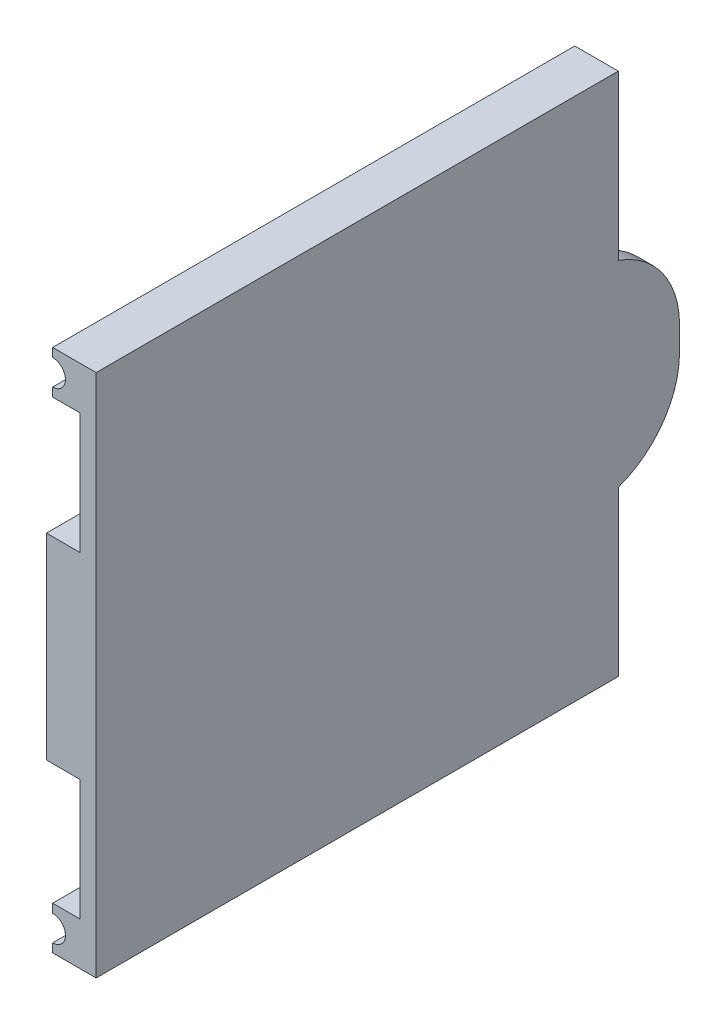
ISO-10303-21;
HEADER;
FILE_DESCRIPTION(('STEP AP214'),'2;1');
FILE_NAME('part.step','',(''),(''),'','','');
FILE_SCHEMA(('AUTOMOTIVE_DESIGN { 1 0 10303 214 1 1 1 1 }'));
ENDSEC;
DATA;
#1=APPLICATION_CONTEXT('core data for automotive mechanical design processes');
#2=APPLICATION_PROTOCOL_DEFINITION('international standard','automotive_design',2000,#1);
#3=PRODUCT_CONTEXT('',#1,'mechanical');
#4=PRODUCT('Part','Part','',(#3));
#5=PRODUCT_RELATED_PRODUCT_CATEGORY('part','',(#4));
#6=PRODUCT_DEFINITION_FORMATION('','',#4);
#7=PRODUCT_DEFINITION_CONTEXT('part definition',#1,'design');
#8=PRODUCT_DEFINITION('design','',#6,#7);
#9=PRODUCT_DEFINITION_SHAPE('','',#8);
#10=(LENGTH_UNIT() NAMED_UNIT(*) SI_UNIT(.MILLI.,.METRE.));
#11=(NAMED_UNIT(*) PLANE_ANGLE_UNIT() SI_UNIT($,.RADIAN.));
#12=(NAMED_UNIT(*) SI_UNIT($,.STERADIAN.) SOLID_ANGLE_UNIT());
#13=UNCERTAINTY_MEASURE_WITH_UNIT(LENGTH_MEASURE(1.E-05),#10,'distance_accuracy_value','');
#14=(GEOMETRIC_REPRESENTATION_CONTEXT(3) GLOBAL_UNCERTAINTY_ASSIGNED_CONTEXT((#13)) GLOBAL_UNIT_ASSIGNED_CONTEXT((#10,
#11,#12)) REPRESENTATION_CONTEXT('',''));
#15=CARTESIAN_POINT('',(0.,0.,0.));
#16=DIRECTION('',(0.,0.,1.));
#17=DIRECTION('',(1.,0.,0.));
#18=AXIS2_PLACEMENT_3D('',#15,#16,#17);
#19=CARTESIAN_POINT('',(-3.31919890539199,-3.42083956571834,-112.268207683529));
#20=DIRECTION('',(-1.,0.,0.));
#21=DIRECTION('',(0.,-1.,0.));
#22=AXIS2_PLACEMENT_3D('',#19,#20,#21);
#23=PLANE('',#22);
#24=DIRECTION('',(0.,0.,-1.));
#25=VECTOR('',#24,1.);
#26=CARTESIAN_POINT('',(-3.31919890539199,1.27705093993988,7.57724668597268));
#27=LINE('',#26,#25);
#28=CARTESIAN_POINT('',(-3.31919890539199,1.27705093993988,2.));
#29=VERTEX_POINT('',#28);
#30=CARTESIAN_POINT('',(-3.31919890539199,1.27705093993988,-55.));
#31=VERTEX_POINT('',#30);
#32=EDGE_CURVE('E225',#29,#31,#27,.T.);
#33=ORIENTED_EDGE('',*,*,#32,.F.);
#34=DIRECTION('',(0.,-1.,0.));
#35=VECTOR('',#34,1.);
#36=CARTESIAN_POINT('',(-3.31919890539199,0.,2.));
#37=LINE('',#36,#35);
#38=CARTESIAN_POINT('',(-3.31919890539199,14.4716869329902,2.));
#39=VERTEX_POINT('',#38);
#40=EDGE_CURVE('E209',#39,#29,#37,.T.);
#41=ORIENTED_EDGE('',*,*,#40,.F.);
#42=DIRECTION('',(0.,0.,-1.));
#43=VECTOR('',#42,1.);
#44=CARTESIAN_POINT('',(-3.31919890539199,14.4716869329902,2.));
#45=LINE('',#44,#43);
#46=CARTESIAN_POINT('',(-3.31919890539199,14.4716869329902,0.));
#47=VERTEX_POINT('',#46);
#48=EDGE_CURVE('E424',#39,#47,#45,.T.);
#49=ORIENTED_EDGE('',*,*,#48,.T.);
#50=DIRECTION('',(0.,-1.,0.));
#51=VECTOR('',#50,1.);
#52=CARTESIAN_POINT('',(-3.31919890539199,-3.42083956571834,0.));
#53=LINE('',#52,#51);
#54=CARTESIAN_POINT('',(-3.31919890539199,35.9283130670098,0.));
#55=VERTEX_POINT('',#54);
#56=EDGE_CURVE('E431',#55,#47,#53,.T.);
#57=ORIENTED_EDGE('',*,*,#56,.F.);
#58=DIRECTION('',(0.,0.,-1.));
#59=VECTOR('',#58,1.);
#60=CARTESIAN_POINT('',(-3.31919890539199,35.9283130670098,2.));
#61=LINE('',#60,#59);
#62=CARTESIAN_POINT('',(-3.31919890539199,35.9283130670098,2.));
#63=VERTEX_POINT('',#62);
#64=EDGE_CURVE('E421',#63,#55,#61,.T.);
#65=ORIENTED_EDGE('',*,*,#64,.F.);
#66=CARTESIAN_POINT('',(-3.31919890539199,49.1229490600601,2.));
#67=VERTEX_POINT('',#66);
#68=EDGE_CURVE('E414',#67,#63,#37,.T.);
#69=ORIENTED_EDGE('',*,*,#68,.F.);
#70=DIRECTION('',(0.,0.,-1.));
#71=VECTOR('',#70,1.);
#72=CARTESIAN_POINT('',(-3.31919890539199,49.1229490600601,7.57724668597268));
#73=LINE('',#72,#71);
#74=CARTESIAN_POINT('',(-3.31919890539199,49.1229490600601,-55.));
#75=VERTEX_POINT('',#74);
#76=EDGE_CURVE('E61',#67,#75,#73,.T.);
#77=ORIENTED_EDGE('',*,*,#76,.T.);
#78=DIRECTION('',(0.,-1.,0.));
#79=VECTOR('',#78,1.);
#80=CARTESIAN_POINT('',(-3.31919890539199,-3.42083956571834,-55.));
#81=LINE('',#80,#79);
#82=CARTESIAN_POINT('',(-3.31919890539199,35.9283130670098,-55.));
#83=VERTEX_POINT('',#82);
#84=EDGE_CURVE('E438',#75,#83,#81,.T.);
#85=ORIENTED_EDGE('',*,*,#84,.T.);
#86=CARTESIAN_POINT('',(-3.31919890539199,26.4921789622735,-51.6895056022655));
#87=DIRECTION('',(-1.,0.,0.));
#88=DIRECTION('',(0.,-1.,0.));
#89=AXIS2_PLACEMENT_3D('',#86,#87,#88);
#90=CIRCLE('',#89,10.);
#91=CARTESIAN_POINT('',(-3.31919890539199,26.4921789622735,-61.6895056022655));
#92=VERTEX_POINT('',#91);
#93=EDGE_CURVE('E355',#83,#92,#90,.T.);
#94=ORIENTED_EDGE('',*,*,#93,.T.);
#95=DIRECTION('',(0.,-1.,0.));
#96=VECTOR('',#95,1.);
#97=CARTESIAN_POINT('',(-3.31919890539199,14.4716869329902,-61.6895056022655));
#98=LINE('',#97,#96);
#99=CARTESIAN_POINT('',(-3.31919890539199,23.9078210377265,-61.6895056022655));
#100=VERTEX_POINT('',#99);
#101=EDGE_CURVE('E382',#92,#100,#98,.T.);
#102=ORIENTED_EDGE('',*,*,#101,.T.);
#103=CARTESIAN_POINT('',(-3.31919890539199,23.9078210377265,-51.6895056022655));
#104=DIRECTION('',(-1.,0.,0.));
#105=DIRECTION('',(0.,-1.,0.));
#106=AXIS2_PLACEMENT_3D('',#103,#104,#105);
#107=CIRCLE('',#106,10.);
#108=CARTESIAN_POINT('',(-3.31919890539199,14.4716869329902,-55.));
#109=VERTEX_POINT('',#108);
#110=EDGE_CURVE('E352',#100,#109,#107,.T.);
#111=ORIENTED_EDGE('',*,*,#110,.T.);
#112=EDGE_CURVE('E434',#109,#31,#81,.T.);
#113=ORIENTED_EDGE('',*,*,#112,.T.);
#114=EDGE_LOOP('',(#33,#41,#49,#57,#65,#69,#77,#85,#94,#102,#111,#113));
#115=FACE_BOUND('',#114,.T.);
#116=CARTESIAN_POINT('',(-3.31919890539199,30.39538039286,-58.0220039860049));
#117=CARTESIAN_POINT('',(-3.319198905392,30.3953731677678,-57.9714231862092));
#118=CARTESIAN_POINT('',(-3.31919890539199,30.3904428501182,-57.9208138964504));
#119=CARTESIAN_POINT('',(-3.31919890539199,30.3713428542698,-57.8213627240695));
#120=CARTESIAN_POINT('',(-3.31919890539199,30.3571584414699,-57.7725237913805));
#121=CARTESIAN_POINT('',(-3.31919890539199,30.3169845291881,-57.6671245654956));
#122=CARTESIAN_POINT('',(-3.31919890539199,30.2890499131978,-57.6113181412229));
#123=CARTESIAN_POINT('',(-3.31919890539199,30.2246526683806,-57.5048902492402));
#124=CARTESIAN_POINT('',(-3.31919890539199,30.188172693613,-57.454279632934));
#125=CARTESIAN_POINT('',(-3.31919890539199,30.1157090989328,-57.3660134687457));
#126=CARTESIAN_POINT('',(-3.31919890539199,30.0806318861256,-57.3275966374521));
#127=CARTESIAN_POINT('',(-3.31919890539199,30.0072792731913,-57.2539202831425));
#128=CARTESIAN_POINT('',(-3.31919890539199,29.9690015660918,-57.2186630762326));
#129=CARTESIAN_POINT('',(-3.31919890539199,29.8899565341299,-57.1509361506898));
#130=CARTESIAN_POINT('',(-3.31919890539199,29.8491848503902,-57.1184715657334));
#131=CARTESIAN_POINT('',(-3.31919890539199,29.7657397238641,-57.0560724165571));
#132=CARTESIAN_POINT('',(-3.31919890539199,29.7230655339333,-57.0261388599198));
#133=CARTESIAN_POINT('',(-3.31919890539199,29.5872628134364,-56.9360219822473));
#134=CARTESIAN_POINT('',(-3.31919890539199,29.4915053599603,-56.879792202171));
#135=CARTESIAN_POINT('',(-3.31919890539199,29.295683757485,-56.7753706745368));
#136=CARTESIAN_POINT('',(-3.31919890539199,29.1956149578093,-56.7271878950047));
#137=CARTESIAN_POINT('',(-3.31919890539199,28.9923808342592,-56.6373684555593));
#138=CARTESIAN_POINT('',(-3.31919890539199,28.8892100667907,-56.5957442128531));
#139=CARTESIAN_POINT('',(-3.31919890539199,28.6808438705801,-56.5181271895554));
#140=CARTESIAN_POINT('',(-3.31919890539199,28.5756492855732,-56.4821321169316));
#141=CARTESIAN_POINT('',(-3.31919890539199,28.3441683831376,-56.4087923640118));
#142=CARTESIAN_POINT('',(-3.31919890539199,28.2175736395103,-56.3724254082112));
#143=CARTESIAN_POINT('',(-3.31919890539199,27.9628280429387,-56.3055809304653));
#144=CARTESIAN_POINT('',(-3.31919890539199,27.834676870222,-56.2751046412967));
#145=CARTESIAN_POINT('',(-3.31919890539199,27.5771210469917,-56.2193723681457));
#146=CARTESIAN_POINT('',(-3.31919890539199,27.4477153057603,-56.1941214524956));
#147=CARTESIAN_POINT('',(-3.31919890539199,27.1880564189304,-56.1484038157457));
#148=CARTESIAN_POINT('',(-3.31919890539199,27.0578031787471,-56.127937638395));
#149=CARTESIAN_POINT('',(-3.31919890539199,26.6653657759517,-56.0730676320124));
#150=CARTESIAN_POINT('',(-3.31919890539199,26.4022291571331,-56.0453443749056));
#151=CARTESIAN_POINT('',(-3.31919890539199,25.8747784650301,-56.0059557222565));
#152=CARTESIAN_POINT('',(-3.31919890539199,25.6104642890529,-55.994291755849));
#153=CARTESIAN_POINT('',(-3.31919890539199,25.1435221586544,-55.9873248347716));
#154=CARTESIAN_POINT('',(-3.31919890539199,24.940936421042,-55.9888313715245));
#155=CARTESIAN_POINT('',(-3.31919890539199,24.5359631366222,-56.0009613699963));
#156=CARTESIAN_POINT('',(-3.31919890539199,24.3335756799347,-56.011587912716));
#157=CARTESIAN_POINT('',(-3.31919890539199,23.9293326267976,-56.0423230594862));
#158=CARTESIAN_POINT('',(-3.31919890539199,23.7274776585225,-56.0624400358134));
#159=CARTESIAN_POINT('',(-3.31919890539199,23.3259243968418,-56.112761554933));
#160=CARTESIAN_POINT('',(-3.31919890539199,23.1262205156411,-56.1429211503804));
#161=CARTESIAN_POINT('',(-3.31919890539199,22.7289326722818,-56.2145017253372));
#162=CARTESIAN_POINT('',(-3.31919890539199,22.5313473026992,-56.2559146758846));
#163=CARTESIAN_POINT('',(-3.31919890539199,22.2375325393806,-56.3279034152221));
#164=CARTESIAN_POINT('',(-3.31919890539199,22.1400793035915,-56.3535261885522));
#165=CARTESIAN_POINT('',(-3.31919890539199,21.9462113548207,-56.4084225369297));
#166=CARTESIAN_POINT('',(-3.31919890539199,21.8497965030453,-56.4376956173174));
#167=CARTESIAN_POINT('',(-3.31919890539199,21.6640695428524,-56.4984526214002));
#168=CARTESIAN_POINT('',(-3.31919890539199,21.5746794472597,-56.5296971280238));
#169=CARTESIAN_POINT('',(-3.31919890539199,21.3974141159262,-56.596300067779));
#170=CARTESIAN_POINT('',(-3.31919890539199,21.3095391692124,-56.6316592760696));
#171=CARTESIAN_POINT('',(-3.31919890539199,21.1360249020998,-56.7070443854754));
#172=CARTESIAN_POINT('',(-3.31919890539199,21.0503811255592,-56.7470599449164));
#173=CARTESIAN_POINT('',(-3.31919890539199,20.8819424437043,-56.8326506848188));
#174=CARTESIAN_POINT('',(-3.31919890539198,20.7991459626123,-56.8782227245465));
#175=CARTESIAN_POINT('',(-3.31919890539199,20.6390922391424,-56.9751787586836));
#176=CARTESIAN_POINT('',(-3.31919890539199,20.5617603353206,-57.0264380386874));
#177=CARTESIAN_POINT('',(-3.31919890539199,20.412836745902,-57.1369586754763));
#178=CARTESIAN_POINT('',(-3.31919890539198,20.3412466612905,-57.1962222518131));
#179=CARTESIAN_POINT('',(-3.31919890539198,20.2215432029528,-57.3109317119151));
#180=CARTESIAN_POINT('',(-3.31919890539198,20.171671946706,-57.3645183460734));
#181=CARTESIAN_POINT('',(-3.319198905392,20.0805819759779,-57.4786395024072));
#182=CARTESIAN_POINT('',(-3.31919890539202,20.0393416458471,-57.5391560656594));
#183=CARTESIAN_POINT('',(-3.31919890539198,19.9809419723428,-57.6465733669036));
#184=CARTESIAN_POINT('',(-3.31919890539195,19.9603063346008,-57.6915653566236));
#185=CARTESIAN_POINT('',(-3.31919890539204,19.926521556339,-57.7842891963429));
#186=CARTESIAN_POINT('',(-3.31919890539216,19.9133632574716,-57.8320176154616));
#187=CARTESIAN_POINT('',(-3.31919890539216,19.8958130532288,-57.9294889410442));
#188=CARTESIAN_POINT('',(-3.31919890539203,19.8914900171774,-57.9792446129013));
#189=CARTESIAN_POINT('',(-3.31919890539195,19.8923694542091,-58.0786750454448));
#190=CARTESIAN_POINT('',(-3.31919890539201,19.8975723282995,-58.1283498026368));
#191=CARTESIAN_POINT('',(-3.31919890539203,19.9158691982099,-58.2209828650277));
#192=CARTESIAN_POINT('',(-3.319198905392,19.928118052928,-58.2641146168201));
#193=CARTESIAN_POINT('',(-3.31919890539198,19.9587596325662,-58.3481833731503));
#194=CARTESIAN_POINT('',(-3.31919890539199,19.9771642452009,-58.3891159518495));
#195=CARTESIAN_POINT('',(-3.319198905392,20.0318627183695,-58.4928405918846));
#196=CARTESIAN_POINT('',(-3.31919890539199,20.0721813029291,-58.5534988240355));
#197=CARTESIAN_POINT('',(-3.31919890539199,20.1615715166141,-58.6679373037319));
#198=CARTESIAN_POINT('',(-3.319198905392,20.2106657615316,-58.7216991486255));
#199=CARTESIAN_POINT('',(-3.319198905392,20.3105801276217,-58.8190933230603));
#200=CARTESIAN_POINT('',(-3.31919890539199,20.3609549885067,-58.8631907866005));
#201=CARTESIAN_POINT('',(-3.31919890539199,20.4651734364998,-58.94686867483));
#202=CARTESIAN_POINT('',(-3.31919890539199,20.5190123276383,-58.9864550211845));
#203=CARTESIAN_POINT('',(-3.31919890539199,20.6294191831758,-59.0619073101988));
#204=CARTESIAN_POINT('',(-3.31919890539199,20.6859939165941,-59.0977632522511));
#205=CARTESIAN_POINT('',(-3.31919890539199,20.8011214163746,-59.1661653354187));
#206=CARTESIAN_POINT('',(-3.31919890539199,20.8596748673699,-59.1987103149983));
#207=CARTESIAN_POINT('',(-3.31919890539199,20.9863832075026,-59.2651376457134));
#208=CARTESIAN_POINT('',(-3.31919890539199,21.0547587464282,-59.298597387727));
#209=CARTESIAN_POINT('',(-3.31919890539199,21.19301768285,-59.3622571666419));
#210=CARTESIAN_POINT('',(-3.31919890539199,21.262901453369,-59.3924563857884));
#211=CARTESIAN_POINT('',(-3.31919890539199,21.4743940363404,-59.4787871751972));
#212=CARTESIAN_POINT('',(-3.31919890539199,21.617766680877,-59.5306126582118));
#213=CARTESIAN_POINT('',(-3.31919890539199,21.9079038705174,-59.6251038848786));
#214=CARTESIAN_POINT('',(-3.31919890539199,22.0546773263706,-59.6677415878001));
#215=CARTESIAN_POINT('',(-3.31919890539199,22.3502201414561,-59.745082591991));
#216=CARTESIAN_POINT('',(-3.31919890539199,22.4989887260339,-59.779788883489));
#217=CARTESIAN_POINT('',(-3.31919890539199,22.868682398793,-59.8570760881156));
#218=CARTESIAN_POINT('',(-3.31919890539199,23.0904518751731,-59.8956162414806));
#219=CARTESIAN_POINT('',(-3.31919890539199,23.5360067971428,-59.9597527484283));
#220=CARTESIAN_POINT('',(-3.31919890539199,23.7597938566672,-59.9853375885214));
#221=CARTESIAN_POINT('',(-3.31919890539199,24.2085288315932,-60.0246641987911));
#222=CARTESIAN_POINT('',(-3.31919890539199,24.4334773563808,-60.0383989411021));
#223=CARTESIAN_POINT('',(-3.31919890539199,24.8832699778078,-60.0545487956879));
#224=CARTESIAN_POINT('',(-3.31919890539199,25.1081131805398,-60.0569891841079));
#225=CARTESIAN_POINT('',(-3.31919890539199,25.5574959756584,-60.0507161390753));
#226=CARTESIAN_POINT('',(-3.31919890539199,25.7820356704156,-60.0420099751162));
#227=CARTESIAN_POINT('',(-3.31919890539199,26.2302640404022,-60.01311946336));
#228=CARTESIAN_POINT('',(-3.31919890539199,26.4539531478679,-59.9929420542595));
#229=CARTESIAN_POINT('',(-3.31919890539199,26.7852599419054,-59.9537856000322));
#230=CARTESIAN_POINT('',(-3.31919890539199,26.8934461703072,-59.9395204256777));
#231=CARTESIAN_POINT('',(-3.31919890539199,27.1093586517186,-59.9079062245694));
#232=CARTESIAN_POINT('',(-3.31919890539199,27.2170849249045,-59.8905573345382));
#233=CARTESIAN_POINT('',(-3.31919890539199,27.5396410424584,-59.8335661970299));
#234=CARTESIAN_POINT('',(-3.31919890539199,27.7536500968183,-59.7890021771124));
#235=CARTESIAN_POINT('',(-3.31919890539199,28.0884404412369,-59.7064039168557));
#236=CARTESIAN_POINT('',(-3.31919890539199,28.2105073872511,-59.6735306297006));
#237=CARTESIAN_POINT('',(-3.31919890539199,28.4528790499343,-59.601856001763));
#238=CARTESIAN_POINT('',(-3.31919890539199,28.5731842015857,-59.5630561522274));
#239=CARTESIAN_POINT('',(-3.31919890539199,28.8110528381245,-59.4786469122576));
#240=CARTESIAN_POINT('',(-3.31919890539199,28.9286225932663,-59.433055340621));
#241=CARTESIAN_POINT('',(-3.31919890539199,29.160177560225,-59.3336188043904));
#242=CARTESIAN_POINT('',(-3.319198905392,29.2741657278764,-59.2797808731486));
#243=CARTESIAN_POINT('',(-3.31919890539199,29.4659154039343,-59.1780807486566));
#244=CARTESIAN_POINT('',(-3.31919890539199,29.544976536332,-59.1326844207122));
#245=CARTESIAN_POINT('',(-3.31919890539199,29.6991547627954,-59.0352441489564));
#246=CARTESIAN_POINT('',(-3.319198905392,29.774265007792,-58.9831891653656));
#247=CARTESIAN_POINT('',(-3.31919890539198,29.9190432909725,-58.8704630019593));
#248=CARTESIAN_POINT('',(-3.31919890539194,29.9886488752392,-58.809710298307));
#249=CARTESIAN_POINT('',(-3.31919890539204,30.1176879733379,-58.6781460401234));
#250=CARTESIAN_POINT('',(-3.31919890539219,30.1771553707359,-58.6073694993936));
#251=CARTESIAN_POINT('',(-3.31919890539209,30.2570937571405,-58.4876442331498));
#252=CARTESIAN_POINT('',(-3.31919890539199,30.2832899675442,-58.4425477043228));
#253=CARTESIAN_POINT('',(-3.31919890539199,30.3285101693583,-58.3488938228001));
#254=CARTESIAN_POINT('',(-3.31919890539209,30.3475482901521,-58.3003435153405));
#255=CARTESIAN_POINT('',(-3.31919890539208,30.3729449235565,-58.2134111711883));
#256=CARTESIAN_POINT('',(-3.31919890539202,30.3813028895796,-58.1756136640741));
#257=CARTESIAN_POINT('',(-3.31919890539197,30.3925221065065,-58.0992173813423));
#258=CARTESIAN_POINT('',(-3.31919890539198,30.3953859087264,-58.0606189860532));
#259=CARTESIAN_POINT('',(-3.31919890539199,30.39538039286,-58.0220039860049));
#260=B_SPLINE_CURVE_WITH_KNOTS('',3,(#116,#117,#118,#119,#120,#121,#122,#123,#124,#125,#126,
#127,#128,#129,#130,#131,#132,#133,#134,#135,#136,#137,#138,#139,#140,#141,#142,#143,#144,#145,
#146,#147,#148,#149,#150,#151,#152,#153,#154,#155,#156,#157,#158,#159,#160,#161,#162,#163,#164,
#165,#166,#167,#168,#169,#170,#171,#172,#173,#174,#175,#176,#177,#178,#179,#180,#181,#182,#183,
#184,#185,#186,#187,#188,#189,#190,#191,#192,#193,#194,#195,#196,#197,#198,#199,#200,#201,#202,
#203,#204,#205,#206,#207,#208,#209,#210,#211,#212,#213,#214,#215,#216,#217,#218,#219,#220,#221,
#222,#223,#224,#225,#226,#227,#228,#229,#230,#231,#232,#233,#234,#235,#236,#237,#238,#239,#240,
#241,#242,#243,#244,#245,#246,#247,#248,#249,#250,#251,#252,#253,#254,#255,#256,#257,#258,#259),
.UNSPECIFIED.,.T.,.F.,(4,2,2,2,2,2,2,2,2,2,2,2,2,2,2,2,2,2,2,2,2,2,2,2,2,2,2,2,2,2,2,2,2,2,2,2,
2,2,2,2,2,2,2,2,2,2,2,2,2,2,2,2,2,2,2,2,2,2,2,2,2,2,2,2,2,2,2,2,2,2,2,4),(0.,0.151569266811629,
0.303380456910023,0.489547453671225,0.676095670362361,0.83194211273161,0.987901876735132,
1.14414247342873,1.3004449782949,1.63300762860086,1.96593846720021,2.29949225635897,
2.63290987662622,3.02788343244795,3.42293955757076,3.81837708826859,4.21385953562081,
5.00704253277725,5.80029611164109,6.40787712801657,7.01566348359995,7.62398702205878,
8.22962370899387,8.83482942008448,9.13706918540612,9.43926803808468,9.72326200892113,
10.0073095675987,10.290737888299,10.5740067408288,10.8519748946178,11.1300202864536,
11.3490541005653,11.5675326133699,11.715502397901,11.8632905541944,12.0122263661795,
12.1611684479796,12.2951496331499,12.4293910650234,12.6466397231273,12.8644565446677,
13.0650080585815,13.2652932032893,13.4661021472685,13.6669812968784,13.8952478005586,
14.1235714222203,14.5804782181647,15.0387603214706,15.496869361346,16.1716759427068,
16.8470811821003,17.5228867051738,18.1971790788158,18.8710319203236,19.5444775964975,
19.8718053080842,20.1991185105722,20.8543422390525,21.2334754986549,21.6125135170821,
21.9905740546259,22.3683139201464,22.6415749741314,22.9152951029545,23.1917729452008,
23.4673078216233,23.6233003485822,23.7789833242211,23.894749920798,24.0104627459984),.UNSPECIFIED.);
#261=CARTESIAN_POINT('',(-3.31919890539199,30.39538039286,-58.0220039860049));
#262=VERTEX_POINT('',#261);
#263=EDGE_CURVE('E44',#262,#262,#260,.T.);
#264=ORIENTED_EDGE('',*,*,#263,.T.);
#265=EDGE_LOOP('',(#264));
#266=FACE_BOUND('',#265,.T.);
#267=ADVANCED_FACE('F40',(#115,#266),#23,.T.);
#268=CARTESIAN_POINT('',(-5.09999999999999,8.6,-55.));
#269=DIRECTION('',(0.,0.,-1.));
#270=DIRECTION('',(0.,-1.,0.));
#271=AXIS2_PLACEMENT_3D('',#268,#269,#270);
#272=PLANE('',#271);
#273=DIRECTION('',(0.,1.,0.));
#274=VECTOR('',#273,1.);
#275=CARTESIAN_POINT('',(-1.57627564332772,-3.42083956571834,-55.));
#276=LINE('',#275,#274);
#277=CARTESIAN_POINT('',(-1.57627564332771,35.9283130670098,-55.));
#278=VERTEX_POINT('',#277);
#279=CARTESIAN_POINT('',(-1.57627564332772,53.8208395657183,-55.));
#280=VERTEX_POINT('',#279);
#281=EDGE_CURVE('E366',#278,#280,#276,.T.);
#282=ORIENTED_EDGE('',*,*,#281,.F.);
#283=DIRECTION('',(-1.,0.,0.));
#284=VECTOR('',#283,1.);
#285=CARTESIAN_POINT('',(-1.57627564332771,35.9283130670098,-55.));
#286=LINE('',#285,#284);
#287=EDGE_CURVE('E373',#278,#83,#286,.T.);
#288=ORIENTED_EDGE('',*,*,#287,.T.);
#289=ORIENTED_EDGE('',*,*,#84,.F.);
#290=DIRECTION('',(-1.,0.,0.));
#291=VECTOR('',#290,1.);
#292=CARTESIAN_POINT('',(-3.31919890539199,49.1229490600601,-55.));
#293=LINE('',#292,#291);
#294=CARTESIAN_POINT('',(-6.32511064611884,49.1229490600601,-55.));
#295=VERTEX_POINT('',#294);
#296=EDGE_CURVE('E241',#75,#295,#293,.T.);
#297=ORIENTED_EDGE('',*,*,#296,.T.);
#298=DIRECTION('',(0.,1.,0.));
#299=VECTOR('',#298,1.);
#300=CARTESIAN_POINT('',(-6.32511064611884,50.0746354328343,-55.));
#301=LINE('',#300,#299);
#302=CARTESIAN_POINT('',(-6.32511064611884,50.0746354328343,-55.));
#303=VERTEX_POINT('',#302);
#304=EDGE_CURVE('E257',#295,#303,#301,.T.);
#305=ORIENTED_EDGE('',*,*,#304,.T.);
#306=CARTESIAN_POINT('',(-6.32511064611884,51.4718943128892,-55.));
#307=DIRECTION('',(0.,0.,1.));
#308=DIRECTION('',(-1.,0.,0.));
#309=AXIS2_PLACEMENT_3D('',#306,#307,#308);
#310=CIRCLE('',#309,1.39725888005494);
#311=CARTESIAN_POINT('',(-6.32511064611884,52.8691531929442,-55.));
#312=VERTEX_POINT('',#311);
#313=EDGE_CURVE('E254',#303,#312,#310,.T.);
#314=ORIENTED_EDGE('',*,*,#313,.T.);
#315=DIRECTION('',(0.,1.,0.));
#316=VECTOR('',#315,1.);
#317=CARTESIAN_POINT('',(-6.32511064611884,53.8208395657183,-55.));
#318=LINE('',#317,#316);
#319=CARTESIAN_POINT('',(-6.32511064611884,53.8208395657183,-55.));
#320=VERTEX_POINT('',#319);
#321=EDGE_CURVE('E250',#312,#320,#318,.T.);
#322=ORIENTED_EDGE('',*,*,#321,.T.);
#323=DIRECTION('',(-1.,0.,0.));
#324=VECTOR('',#323,1.);
#325=CARTESIAN_POINT('',(-3.31919890539199,53.8208395657183,-55.));
#326=LINE('',#325,#324);
#327=EDGE_CURVE('E374',#280,#320,#326,.T.);
#328=ORIENTED_EDGE('',*,*,#327,.F.);
#329=EDGE_LOOP('',(#282,#288,#289,#297,#305,#314,#322,#328));
#330=FACE_BOUND('',#329,.T.);
#331=ADVANCED_FACE('F333',(#330),#272,.T.);
#332=DIRECTION('',(-1.,0.,0.));
#333=VECTOR('',#332,1.);
#334=CARTESIAN_POINT('',(-1.57627564332771,14.4716869329902,-55.));
#335=LINE('',#334,#333);
#336=CARTESIAN_POINT('',(-1.57627564332771,14.4716869329902,-55.));
#337=VERTEX_POINT('',#336);
#338=EDGE_CURVE('E349',#337,#109,#335,.T.);
#339=ORIENTED_EDGE('',*,*,#338,.F.);
#340=CARTESIAN_POINT('',(-1.57627564332772,-3.42083956571834,-55.));
#341=VERTEX_POINT('',#340);
#342=EDGE_CURVE('E376',#341,#337,#276,.T.);
#343=ORIENTED_EDGE('',*,*,#342,.F.);
#344=DIRECTION('',(1.,0.,0.));
#345=VECTOR('',#344,1.);
#346=CARTESIAN_POINT('',(-3.31919890539199,-3.42083956571834,-55.));
#347=LINE('',#346,#345);
#348=CARTESIAN_POINT('',(-6.32511064611884,-3.42083956571834,-55.));
#349=VERTEX_POINT('',#348);
#350=EDGE_CURVE('E436',#349,#341,#347,.T.);
#351=ORIENTED_EDGE('',*,*,#350,.F.);
#352=DIRECTION('',(0.,1.,0.));
#353=VECTOR('',#352,1.);
#354=CARTESIAN_POINT('',(-6.32511064611884,-3.42083956571834,-55.));
#355=LINE('',#354,#353);
#356=CARTESIAN_POINT('',(-6.32511064611884,-2.46915319294418,-55.));
#357=VERTEX_POINT('',#356);
#358=EDGE_CURVE('E224',#349,#357,#355,.T.);
#359=ORIENTED_EDGE('',*,*,#358,.T.);
#360=CARTESIAN_POINT('',(-6.32511064611884,-1.07189431288923,-55.));
#361=DIRECTION('',(0.,0.,1.));
#362=DIRECTION('',(1.,0.,0.));
#363=AXIS2_PLACEMENT_3D('',#360,#361,#362);
#364=CIRCLE('',#363,1.39725888005494);
#365=CARTESIAN_POINT('',(-6.32511064611884,0.325364567165712,-55.));
#366=VERTEX_POINT('',#365);
#367=EDGE_CURVE('E242',#357,#366,#364,.T.);
#368=ORIENTED_EDGE('',*,*,#367,.T.);
#369=DIRECTION('',(0.,1.,0.));
#370=VECTOR('',#369,1.);
#371=CARTESIAN_POINT('',(-6.32511064611884,0.325364567165712,-55.));
#372=LINE('',#371,#370);
#373=CARTESIAN_POINT('',(-6.32511064611884,1.27705093993988,-55.));
#374=VERTEX_POINT('',#373);
#375=EDGE_CURVE('E245',#366,#374,#372,.T.);
#376=ORIENTED_EDGE('',*,*,#375,.T.);
#377=DIRECTION('',(1.,0.,0.));
#378=VECTOR('',#377,1.);
#379=CARTESIAN_POINT('',(-3.31919890539199,1.27705093993988,-55.));
#380=LINE('',#379,#378);
#381=EDGE_CURVE('E219',#374,#31,#380,.T.);
#382=ORIENTED_EDGE('',*,*,#381,.T.);
#383=ORIENTED_EDGE('',*,*,#112,.F.);
#384=EDGE_LOOP('',(#339,#343,#351,#359,#368,#376,#382,#383));
#385=FACE_BOUND('',#384,.T.);
#386=ADVANCED_FACE('F337',(#385),#272,.T.);
#387=CARTESIAN_POINT('',(-3.31919890539199,53.8208395657183,-112.268207683529));
#388=DIRECTION('',(0.,1.,0.));
#389=DIRECTION('',(0.,0.,1.));
#390=AXIS2_PLACEMENT_3D('',#387,#388,#389);
#391=PLANE('',#390);
#392=DIRECTION('',(0.,0.,1.));
#393=VECTOR('',#392,1.);
#394=CARTESIAN_POINT('',(-1.57627564332772,53.8208395657183,-112.268207683529));
#395=LINE('',#394,#393);
#396=CARTESIAN_POINT('',(-1.57627564332772,53.8208395657183,2.));
#397=VERTEX_POINT('',#396);
#398=EDGE_CURVE('E359',#280,#397,#395,.T.);
#399=ORIENTED_EDGE('',*,*,#398,.F.);
#400=ORIENTED_EDGE('',*,*,#327,.T.);
#401=DIRECTION('',(0.,0.,-1.));
#402=VECTOR('',#401,1.);
#403=CARTESIAN_POINT('',(-6.32511064611884,53.8208395657183,7.57724668597268));
#404=LINE('',#403,#402);
#405=CARTESIAN_POINT('',(-6.32511064611884,53.8208395657183,2.));
#406=VERTEX_POINT('',#405);
#407=EDGE_CURVE('E267',#406,#320,#404,.T.);
#408=ORIENTED_EDGE('',*,*,#407,.F.);
#409=DIRECTION('',(-1.,0.,0.));
#410=VECTOR('',#409,1.);
#411=CARTESIAN_POINT('',(0.,53.8208395657183,2.));
#412=LINE('',#411,#410);
#413=EDGE_CURVE('E417',#397,#406,#412,.T.);
#414=ORIENTED_EDGE('',*,*,#413,.F.);
#415=EDGE_LOOP('',(#399,#400,#408,#414));
#416=FACE_BOUND('',#415,.T.);
#417=ADVANCED_FACE('F329',(#416),#391,.T.);
#418=CARTESIAN_POINT('',(-3.31919890539199,-3.42083956571834,-112.268207683529));
#419=DIRECTION('',(0.,-1.,0.));
#420=DIRECTION('',(0.,0.,-1.));
#421=AXIS2_PLACEMENT_3D('',#418,#419,#420);
#422=PLANE('',#421);
#423=DIRECTION('',(1.,0.,0.));
#424=VECTOR('',#423,1.);
#425=CARTESIAN_POINT('',(0.,-3.42083956571834,2.));
#426=LINE('',#425,#424);
#427=CARTESIAN_POINT('',(-6.32511064611884,-3.42083956571834,2.));
#428=VERTEX_POINT('',#427);
#429=CARTESIAN_POINT('',(-1.57627564332772,-3.42083956571834,2.));
#430=VERTEX_POINT('',#429);
#431=EDGE_CURVE('E196',#428,#430,#426,.T.);
#432=ORIENTED_EDGE('',*,*,#431,.F.);
#433=DIRECTION('',(0.,0.,-1.));
#434=VECTOR('',#433,1.);
#435=CARTESIAN_POINT('',(-6.32511064611884,-3.42083956571834,7.57724668597268));
#436=LINE('',#435,#434);
#437=EDGE_CURVE('E201',#428,#349,#436,.T.);
#438=ORIENTED_EDGE('',*,*,#437,.T.);
#439=ORIENTED_EDGE('',*,*,#350,.T.);
#440=DIRECTION('',(0.,0.,1.));
#441=VECTOR('',#440,1.);
#442=CARTESIAN_POINT('',(-1.57627564332772,-3.42083956571834,-112.268207683529));
#443=LINE('',#442,#441);
#444=EDGE_CURVE('E204',#341,#430,#443,.T.);
#445=ORIENTED_EDGE('',*,*,#444,.T.);
#446=EDGE_LOOP('',(#432,#438,#439,#445));
#447=FACE_BOUND('',#446,.T.);
#448=ADVANCED_FACE('F198',(#447),#422,.T.);
#449=CARTESIAN_POINT('',(-1.57627564332772,-3.42083956571834,-112.268207683529));
#450=DIRECTION('',(1.,0.,0.));
#451=DIRECTION('',(0.,1.,0.));
#452=AXIS2_PLACEMENT_3D('',#449,#450,#451);
#453=PLANE('',#452);
#454=ORIENTED_EDGE('',*,*,#342,.T.);
#455=CARTESIAN_POINT('',(-1.57627564332772,23.9078210377265,-51.6895056022655));
#456=DIRECTION('',(1.,0.,0.));
#457=DIRECTION('',(0.,1.,0.));
#458=AXIS2_PLACEMENT_3D('',#455,#456,#457);
#459=CIRCLE('',#458,10.);
#460=CARTESIAN_POINT('',(-1.57627564332772,23.9078210377265,-61.6895056022655));
#461=VERTEX_POINT('',#460);
#462=EDGE_CURVE('E11',#337,#461,#459,.T.);
#463=ORIENTED_EDGE('',*,*,#462,.T.);
#464=DIRECTION('',(0.,-1.,0.));
#465=VECTOR('',#464,1.);
#466=CARTESIAN_POINT('',(-1.57627564332771,14.4716869329902,-61.6895056022655));
#467=LINE('',#466,#465);
#468=CARTESIAN_POINT('',(-1.57627564332772,26.4921789622735,-61.6895056022655));
#469=VERTEX_POINT('',#468);
#470=EDGE_CURVE('E284',#469,#461,#467,.T.);
#471=ORIENTED_EDGE('',*,*,#470,.F.);
#472=CARTESIAN_POINT('',(-1.57627564332772,26.4921789622735,-51.6895056022655));
#473=DIRECTION('',(1.,0.,0.));
#474=DIRECTION('',(0.,1.,0.));
#475=AXIS2_PLACEMENT_3D('',#472,#473,#474);
#476=CIRCLE('',#475,10.);
#477=EDGE_CURVE('E54',#469,#278,#476,.T.);
#478=ORIENTED_EDGE('',*,*,#477,.T.);
#479=ORIENTED_EDGE('',*,*,#281,.T.);
#480=ORIENTED_EDGE('',*,*,#398,.T.);
#481=DIRECTION('',(0.,1.,0.));
#482=VECTOR('',#481,1.);
#483=CARTESIAN_POINT('',(-1.57627564332772,0.,2.));
#484=LINE('',#483,#482);
#485=EDGE_CURVE('E208',#430,#397,#484,.T.);
#486=ORIENTED_EDGE('',*,*,#485,.F.);
#487=ORIENTED_EDGE('',*,*,#444,.F.);
#488=EDGE_LOOP('',(#454,#463,#471,#478,#479,#480,#486,#487));
#489=FACE_BOUND('',#488,.T.);
#490=ADVANCED_FACE('F314',(#489),#453,.T.);
#491=CARTESIAN_POINT('',(0.,0.,0.));
#492=DIRECTION('',(0.,0.,1.));
#493=DIRECTION('',(1.,0.,0.));
#494=AXIS2_PLACEMENT_3D('',#491,#492,#493);
#495=PLANE('',#494);
#496=DIRECTION('',(1.,0.,0.));
#497=VECTOR('',#496,1.);
#498=CARTESIAN_POINT('',(0.,14.4716869329902,0.));
#499=LINE('',#498,#497);
#500=CARTESIAN_POINT('',(-5.33260524197858,14.4716869329902,0.));
#501=VERTEX_POINT('',#500);
#502=EDGE_CURVE('E408',#501,#47,#499,.T.);
#503=ORIENTED_EDGE('',*,*,#502,.F.);
#504=DIRECTION('',(0.,1.,0.));
#505=VECTOR('',#504,1.);
#506=CARTESIAN_POINT('',(-5.33260524197859,14.4716869329902,0.));
#507=LINE('',#506,#505);
#508=CARTESIAN_POINT('',(-5.33260524197858,35.9283130670098,0.));
#509=VERTEX_POINT('',#508);
#510=EDGE_CURVE('E400',#501,#509,#507,.T.);
#511=ORIENTED_EDGE('',*,*,#510,.T.);
#512=DIRECTION('',(1.,0.,0.));
#513=VECTOR('',#512,1.);
#514=CARTESIAN_POINT('',(0.,35.9283130670098,0.));
#515=LINE('',#514,#513);
#516=EDGE_CURVE('E403',#509,#55,#515,.T.);
#517=ORIENTED_EDGE('',*,*,#516,.T.);
#518=ORIENTED_EDGE('',*,*,#56,.T.);
#519=EDGE_LOOP('',(#503,#511,#517,#518));
#520=FACE_BOUND('',#519,.T.);
#521=ADVANCED_FACE('F310',(#520),#495,.F.);
#522=CARTESIAN_POINT('',(0.,35.9283130670098,2.));
#523=DIRECTION('',(0.,1.,0.));
#524=DIRECTION('',(0.,0.,1.));
#525=AXIS2_PLACEMENT_3D('',#522,#523,#524);
#526=PLANE('',#525);
#527=ORIENTED_EDGE('',*,*,#516,.F.);
#528=DIRECTION('',(0.,0.,1.));
#529=VECTOR('',#528,1.);
#530=CARTESIAN_POINT('',(-5.33260524197858,35.9283130670098,-112.268207683529));
#531=LINE('',#530,#529);
#532=CARTESIAN_POINT('',(-5.33260524197858,35.9283130670098,-55.));
#533=VERTEX_POINT('',#532);
#534=EDGE_CURVE('E380',#533,#509,#531,.T.);
#535=ORIENTED_EDGE('',*,*,#534,.F.);
#536=DIRECTION('',(-1.,0.,0.));
#537=VECTOR('',#536,1.);
#538=CARTESIAN_POINT('',(-7.00411238933349,35.9283130670098,-55.));
#539=LINE('',#538,#537);
#540=CARTESIAN_POINT('',(-7.00411238933349,35.9283130670098,-55.));
#541=VERTEX_POINT('',#540);
#542=EDGE_CURVE('E393',#533,#541,#539,.T.);
#543=ORIENTED_EDGE('',*,*,#542,.T.);
#544=DIRECTION('',(0.,0.,-1.));
#545=VECTOR('',#544,1.);
#546=CARTESIAN_POINT('',(-7.00411238933349,35.9283130670098,2.));
#547=LINE('',#546,#545);
#548=CARTESIAN_POINT('',(-7.00411238933349,35.9283130670098,2.));
#549=VERTEX_POINT('',#548);
#550=EDGE_CURVE('E429',#549,#541,#547,.T.);
#551=ORIENTED_EDGE('',*,*,#550,.F.);
#552=DIRECTION('',(1.,0.,0.));
#553=VECTOR('',#552,1.);
#554=CARTESIAN_POINT('',(0.,35.9283130670098,2.));
#555=LINE('',#554,#553);
#556=EDGE_CURVE('E404',#549,#63,#555,.T.);
#557=ORIENTED_EDGE('',*,*,#556,.T.);
#558=ORIENTED_EDGE('',*,*,#64,.T.);
#559=EDGE_LOOP('',(#527,#535,#543,#551,#557,#558));
#560=FACE_BOUND('',#559,.T.);
#561=ADVANCED_FACE('F313',(#560),#526,.T.);
#562=CARTESIAN_POINT('',(-7.00411238933349,0.,2.));
#563=DIRECTION('',(-1.,0.,0.));
#564=DIRECTION('',(0.,0.,1.));
#565=AXIS2_PLACEMENT_3D('',#562,#563,#564);
#566=PLANE('',#565);
#567=ORIENTED_EDGE('',*,*,#550,.T.);
#568=DIRECTION('',(0.,-1.,0.));
#569=VECTOR('',#568,1.);
#570=CARTESIAN_POINT('',(-7.00411238933349,14.4716869329902,-55.));
#571=LINE('',#570,#569);
#572=CARTESIAN_POINT('',(-7.00411238933349,14.4716869329902,-55.));
#573=VERTEX_POINT('',#572);
#574=EDGE_CURVE('E390',#541,#573,#571,.T.);
#575=ORIENTED_EDGE('',*,*,#574,.T.);
#576=DIRECTION('',(0.,0.,-1.));
#577=VECTOR('',#576,1.);
#578=CARTESIAN_POINT('',(-7.00411238933349,14.4716869329902,2.));
#579=LINE('',#578,#577);
#580=CARTESIAN_POINT('',(-7.00411238933349,14.4716869329902,2.));
#581=VERTEX_POINT('',#580);
#582=EDGE_CURVE('E427',#581,#573,#579,.T.);
#583=ORIENTED_EDGE('',*,*,#582,.F.);
#584=DIRECTION('',(0.,1.,0.));
#585=VECTOR('',#584,1.);
#586=CARTESIAN_POINT('',(-7.00411238933349,0.,2.));
#587=LINE('',#586,#585);
#588=EDGE_CURVE('E407',#581,#549,#587,.T.);
#589=ORIENTED_EDGE('',*,*,#588,.T.);
#590=EDGE_LOOP('',(#567,#575,#583,#589));
#591=FACE_BOUND('',#590,.T.);
#592=ADVANCED_FACE('F318',(#591),#566,.T.);
#593=CARTESIAN_POINT('',(0.,14.4716869329902,2.));
#594=DIRECTION('',(0.,1.,0.));
#595=DIRECTION('',(0.,0.,1.));
#596=AXIS2_PLACEMENT_3D('',#593,#594,#595);
#597=PLANE('',#596);
#598=ORIENTED_EDGE('',*,*,#582,.T.);
#599=DIRECTION('',(1.,0.,0.));
#600=VECTOR('',#599,1.);
#601=CARTESIAN_POINT('',(-7.00411238933349,14.4716869329902,-55.));
#602=LINE('',#601,#600);
#603=CARTESIAN_POINT('',(-5.33260524197859,14.4716869329902,-55.));
#604=VERTEX_POINT('',#603);
#605=EDGE_CURVE('E389',#573,#604,#602,.T.);
#606=ORIENTED_EDGE('',*,*,#605,.T.);
#607=DIRECTION('',(0.,0.,1.));
#608=VECTOR('',#607,1.);
#609=CARTESIAN_POINT('',(-5.33260524197859,14.4716869329902,-112.268207683529));
#610=LINE('',#609,#608);
#611=EDGE_CURVE('E386',#604,#501,#610,.T.);
#612=ORIENTED_EDGE('',*,*,#611,.T.);
#613=ORIENTED_EDGE('',*,*,#502,.T.);
#614=ORIENTED_EDGE('',*,*,#48,.F.);
#615=DIRECTION('',(1.,0.,0.));
#616=VECTOR('',#615,1.);
#617=CARTESIAN_POINT('',(0.,14.4716869329902,2.));
#618=LINE('',#617,#616);
#619=EDGE_CURVE('E411',#581,#39,#618,.T.);
#620=ORIENTED_EDGE('',*,*,#619,.F.);
#621=EDGE_LOOP('',(#598,#606,#612,#613,#614,#620));
#622=FACE_BOUND('',#621,.T.);
#623=ADVANCED_FACE('F309',(#622),#597,.F.);
#624=CARTESIAN_POINT('',(0.,0.,2.));
#625=DIRECTION('',(0.,0.,1.));
#626=DIRECTION('',(1.,0.,0.));
#627=AXIS2_PLACEMENT_3D('',#624,#625,#626);
#628=PLANE('',#627);
#629=ORIENTED_EDGE('',*,*,#556,.F.);
#630=ORIENTED_EDGE('',*,*,#588,.F.);
#631=ORIENTED_EDGE('',*,*,#619,.T.);
#632=ORIENTED_EDGE('',*,*,#40,.T.);
#633=DIRECTION('',(1.,0.,0.));
#634=VECTOR('',#633,1.);
#635=CARTESIAN_POINT('',(-3.31919890539199,1.27705093993988,2.));
#636=LINE('',#635,#634);
#637=CARTESIAN_POINT('',(-6.32511064611884,1.27705093993988,2.));
#638=VERTEX_POINT('',#637);
#639=EDGE_CURVE('E227',#638,#29,#636,.T.);
#640=ORIENTED_EDGE('',*,*,#639,.F.);
#641=DIRECTION('',(0.,1.,0.));
#642=VECTOR('',#641,1.);
#643=CARTESIAN_POINT('',(-6.32511064611884,0.325364567165712,2.));
#644=LINE('',#643,#642);
#645=CARTESIAN_POINT('',(-6.32511064611884,0.325364567165712,2.));
#646=VERTEX_POINT('',#645);
#647=EDGE_CURVE('E233',#646,#638,#644,.T.);
#648=ORIENTED_EDGE('',*,*,#647,.F.);
#649=CARTESIAN_POINT('',(-6.32511064611884,-1.07189431288923,2.));
#650=DIRECTION('',(0.,0.,1.));
#651=DIRECTION('',(1.,0.,0.));
#652=AXIS2_PLACEMENT_3D('',#649,#650,#651);
#653=CIRCLE('',#652,1.39725888005494);
#654=CARTESIAN_POINT('',(-6.32511064611884,-2.46915319294418,2.));
#655=VERTEX_POINT('',#654);
#656=EDGE_CURVE('E216',#655,#646,#653,.T.);
#657=ORIENTED_EDGE('',*,*,#656,.F.);
#658=DIRECTION('',(0.,1.,0.));
#659=VECTOR('',#658,1.);
#660=CARTESIAN_POINT('',(-6.32511064611884,-3.42083956571834,2.));
#661=LINE('',#660,#659);
#662=EDGE_CURVE('E212',#428,#655,#661,.T.);
#663=ORIENTED_EDGE('',*,*,#662,.F.);
#664=ORIENTED_EDGE('',*,*,#431,.T.);
#665=ORIENTED_EDGE('',*,*,#485,.T.);
#666=ORIENTED_EDGE('',*,*,#413,.T.);
#667=DIRECTION('',(0.,1.,0.));
#668=VECTOR('',#667,1.);
#669=CARTESIAN_POINT('',(-6.32511064611884,53.8208395657183,2.));
#670=LINE('',#669,#668);
#671=CARTESIAN_POINT('',(-6.32511064611884,52.8691531929442,2.));
#672=VERTEX_POINT('',#671);
#673=EDGE_CURVE('E264',#672,#406,#670,.T.);
#674=ORIENTED_EDGE('',*,*,#673,.F.);
#675=CARTESIAN_POINT('',(-6.32511064611884,51.4718943128892,2.));
#676=DIRECTION('',(0.,0.,1.));
#677=DIRECTION('',(1.,0.,0.));
#678=AXIS2_PLACEMENT_3D('',#675,#676,#677);
#679=CIRCLE('',#678,1.39725888005494);
#680=CARTESIAN_POINT('',(-6.32511064611884,50.0746354328343,2.));
#681=VERTEX_POINT('',#680);
#682=EDGE_CURVE('E269',#681,#672,#679,.T.);
#683=ORIENTED_EDGE('',*,*,#682,.F.);
#684=DIRECTION('',(0.,1.,0.));
#685=VECTOR('',#684,1.);
#686=CARTESIAN_POINT('',(-6.32511064611884,50.0746354328343,2.));
#687=LINE('',#686,#685);
#688=CARTESIAN_POINT('',(-6.32511064611884,49.1229490600601,2.));
#689=VERTEX_POINT('',#688);
#690=EDGE_CURVE('E273',#689,#681,#687,.T.);
#691=ORIENTED_EDGE('',*,*,#690,.F.);
#692=DIRECTION('',(-1.,0.,0.));
#693=VECTOR('',#692,1.);
#694=CARTESIAN_POINT('',(-3.31919890539199,49.1229490600601,2.));
#695=LINE('',#694,#693);
#696=EDGE_CURVE('E253',#67,#689,#695,.T.);
#697=ORIENTED_EDGE('',*,*,#696,.F.);
#698=ORIENTED_EDGE('',*,*,#68,.T.);
#699=EDGE_LOOP('',(#629,#630,#631,#632,#640,#648,#657,#663,#664,#665,#666,#674,#683,#691,#697,#698));
#700=FACE_BOUND('',#699,.T.);
#701=ADVANCED_FACE('F214',(#700),#628,.T.);
#702=CARTESIAN_POINT('',(-5.09999999999999,8.6,-55.));
#703=DIRECTION('',(0.,0.,-1.));
#704=DIRECTION('',(0.,-1.,0.));
#705=AXIS2_PLACEMENT_3D('',#702,#703,#704);
#706=PLANE('',#705);
#707=DIRECTION('',(0.,1.,0.));
#708=VECTOR('',#707,1.);
#709=CARTESIAN_POINT('',(-5.33260524197859,14.4716869329902,-55.));
#710=LINE('',#709,#708);
#711=EDGE_CURVE('E385',#604,#533,#710,.T.);
#712=ORIENTED_EDGE('',*,*,#711,.F.);
#713=ORIENTED_EDGE('',*,*,#605,.F.);
#714=ORIENTED_EDGE('',*,*,#574,.F.);
#715=ORIENTED_EDGE('',*,*,#542,.F.);
#716=EDGE_LOOP('',(#712,#713,#714,#715));
#717=FACE_BOUND('',#716,.T.);
#718=ADVANCED_FACE('F300',(#717),#706,.T.);
#719=CARTESIAN_POINT('',(-5.33260524197859,14.4716869329902,-112.268207683529));
#720=DIRECTION('',(1.,0.,0.));
#721=DIRECTION('',(0.,1.,0.));
#722=AXIS2_PLACEMENT_3D('',#719,#720,#721);
#723=PLANE('',#722);
#724=ORIENTED_EDGE('',*,*,#611,.F.);
#725=ORIENTED_EDGE('',*,*,#711,.T.);
#726=ORIENTED_EDGE('',*,*,#534,.T.);
#727=ORIENTED_EDGE('',*,*,#510,.F.);
#728=EDGE_LOOP('',(#724,#725,#726,#727));
#729=FACE_BOUND('',#728,.T.);
#730=ADVANCED_FACE('F298',(#729),#723,.T.);
#731=CARTESIAN_POINT('',(-1.57627564332771,14.4716869329902,-61.6895056022655));
#732=DIRECTION('',(0.,0.,-1.));
#733=DIRECTION('',(-1.,0.,0.));
#734=AXIS2_PLACEMENT_3D('',#731,#732,#733);
#735=PLANE('',#734);
#736=ORIENTED_EDGE('',*,*,#470,.T.);
#737=DIRECTION('',(-1.,0.,0.));
#738=VECTOR('',#737,1.);
#739=CARTESIAN_POINT('',(-3.31919890539199,23.9078210377265,-61.6895056022655));
#740=LINE('',#739,#738);
#741=EDGE_CURVE('E351',#461,#100,#740,.T.);
#742=ORIENTED_EDGE('',*,*,#741,.T.);
#743=ORIENTED_EDGE('',*,*,#101,.F.);
#744=DIRECTION('',(1.,0.,0.));
#745=VECTOR('',#744,1.);
#746=CARTESIAN_POINT('',(-1.57627564332771,26.4921789622735,-61.6895056022655));
#747=LINE('',#746,#745);
#748=EDGE_CURVE('E356',#92,#469,#747,.T.);
#749=ORIENTED_EDGE('',*,*,#748,.T.);
#750=EDGE_LOOP('',(#736,#742,#743,#749));
#751=FACE_BOUND('',#750,.T.);
#752=ADVANCED_FACE('F294',(#751),#735,.T.);
#753=CARTESIAN_POINT('',(-1.57627564332771,23.9078210377265,-51.6895056022655));
#754=DIRECTION('',(1.,0.,0.));
#755=DIRECTION('',(0.,1.,0.));
#756=AXIS2_PLACEMENT_3D('',#753,#754,#755);
#757=CYLINDRICAL_SURFACE('',#756,10.);
#758=ORIENTED_EDGE('',*,*,#462,.F.);
#759=ORIENTED_EDGE('',*,*,#338,.T.);
#760=ORIENTED_EDGE('',*,*,#110,.F.);
#761=ORIENTED_EDGE('',*,*,#741,.F.);
#762=EDGE_LOOP('',(#758,#759,#760,#761));
#763=FACE_BOUND('',#762,.T.);
#764=ADVANCED_FACE('F297',(#763),#757,.T.);
#765=CARTESIAN_POINT('',(-1.57627564332771,26.4921789622735,-51.6895056022655));
#766=DIRECTION('',(-1.,0.,0.));
#767=DIRECTION('',(0.,-1.,0.));
#768=AXIS2_PLACEMENT_3D('',#765,#766,#767);
#769=CYLINDRICAL_SURFACE('',#768,10.);
#770=ORIENTED_EDGE('',*,*,#477,.F.);
#771=ORIENTED_EDGE('',*,*,#748,.F.);
#772=ORIENTED_EDGE('',*,*,#93,.F.);
#773=ORIENTED_EDGE('',*,*,#287,.F.);
#774=EDGE_LOOP('',(#770,#771,#772,#773));
#775=FACE_BOUND('',#774,.T.);
#776=ADVANCED_FACE('F42',(#775),#769,.T.);
#777=CARTESIAN_POINT('',(-4.31919890539199,25.143639696972,-58.0220039860049));
#778=DIRECTION('',(-1.,0.,0.));
#779=DIRECTION('',(0.,-1.,0.));
#780=AXIS2_PLACEMENT_3D('',#777,#778,#779);
#781=ELLIPSE('',#780,5.85259270292572,2.26578291168026);
#782=TRIMMED_CURVE('',#781,(PARAMETER_VALUE(3.14159265358979)),
(PARAMETER_VALUE(6.28318530717959)),.T.,.PARAMETER.);
#783=CARTESIAN_POINT('',(-4.31919890539199,19.2910469940463,-58.0220039860049));
#784=DIRECTION('',(0.,-1.,0.));
#785=AXIS1_PLACEMENT('',#783,#784);
#786=SURFACE_OF_REVOLUTION('',#782,#785);
#787=ORIENTED_EDGE('',*,*,#263,.F.);
#788=EDGE_LOOP('',(#787));
#789=FACE_BOUND('',#788,.T.);
#790=ADVANCED_FACE('F286',(#789),#786,.F.);
#791=CARTESIAN_POINT('',(-3.31919890539199,49.1229490600601,7.57724668597268));
#792=DIRECTION('',(0.,-1.,0.));
#793=DIRECTION('',(0.,0.,-1.));
#794=AXIS2_PLACEMENT_3D('',#791,#792,#793);
#795=PLANE('',#794);
#796=ORIENTED_EDGE('',*,*,#76,.F.);
#797=ORIENTED_EDGE('',*,*,#696,.T.);
#798=DIRECTION('',(0.,0.,-1.));
#799=VECTOR('',#798,1.);
#800=CARTESIAN_POINT('',(-6.32511064611884,49.1229490600601,7.57724668597268));
#801=LINE('',#800,#799);
#802=EDGE_CURVE('E263',#689,#295,#801,.T.);
#803=ORIENTED_EDGE('',*,*,#802,.T.);
#804=ORIENTED_EDGE('',*,*,#296,.F.);
#805=EDGE_LOOP('',(#796,#797,#803,#804));
#806=FACE_BOUND('',#805,.T.);
#807=ADVANCED_FACE('F291',(#806),#795,.T.);
#808=CARTESIAN_POINT('',(-6.32511064611884,50.0746354328343,7.57724668597268));
#809=DIRECTION('',(-1.,0.,0.));
#810=DIRECTION('',(0.,0.,1.));
#811=AXIS2_PLACEMENT_3D('',#808,#809,#810);
#812=PLANE('',#811);
#813=ORIENTED_EDGE('',*,*,#802,.F.);
#814=ORIENTED_EDGE('',*,*,#690,.T.);
#815=DIRECTION('',(0.,0.,-1.));
#816=VECTOR('',#815,1.);
#817=CARTESIAN_POINT('',(-6.32511064611884,50.0746354328343,7.57724668597268));
#818=LINE('',#817,#816);
#819=EDGE_CURVE('E272',#681,#303,#818,.T.);
#820=ORIENTED_EDGE('',*,*,#819,.T.);
#821=ORIENTED_EDGE('',*,*,#304,.F.);
#822=EDGE_LOOP('',(#813,#814,#820,#821));
#823=FACE_BOUND('',#822,.T.);
#824=ADVANCED_FACE('F453',(#823),#812,.T.);
#825=CARTESIAN_POINT('',(-6.32511064611884,51.4718943128892,7.57724668597268));
#826=DIRECTION('',(0.,0.,-1.));
#827=DIRECTION('',(-1.,0.,0.));
#828=AXIS2_PLACEMENT_3D('',#825,#826,#827);
#829=CYLINDRICAL_SURFACE('',#828,1.39725888005494);
#830=ORIENTED_EDGE('',*,*,#819,.F.);
#831=ORIENTED_EDGE('',*,*,#682,.T.);
#832=DIRECTION('',(0.,0.,-1.));
#833=VECTOR('',#832,1.);
#834=CARTESIAN_POINT('',(-6.32511064611884,52.8691531929442,7.57724668597268));
#835=LINE('',#834,#833);
#836=EDGE_CURVE('E268',#672,#312,#835,.T.);
#837=ORIENTED_EDGE('',*,*,#836,.T.);
#838=ORIENTED_EDGE('',*,*,#313,.F.);
#839=EDGE_LOOP('',(#830,#831,#837,#838));
#840=FACE_BOUND('',#839,.T.);
#841=ADVANCED_FACE('F450',(#840),#829,.F.);
#842=CARTESIAN_POINT('',(-6.32511064611884,53.8208395657183,7.57724668597268));
#843=DIRECTION('',(-1.,0.,0.));
#844=DIRECTION('',(0.,0.,1.));
#845=AXIS2_PLACEMENT_3D('',#842,#843,#844);
#846=PLANE('',#845);
#847=ORIENTED_EDGE('',*,*,#836,.F.);
#848=ORIENTED_EDGE('',*,*,#673,.T.);
#849=ORIENTED_EDGE('',*,*,#407,.T.);
#850=ORIENTED_EDGE('',*,*,#321,.F.);
#851=EDGE_LOOP('',(#847,#848,#849,#850));
#852=FACE_BOUND('',#851,.T.);
#853=ADVANCED_FACE('F445',(#852),#846,.T.);
#854=CARTESIAN_POINT('',(-6.32511064611884,-3.42083956571834,7.57724668597268));
#855=DIRECTION('',(-1.,0.,0.));
#856=DIRECTION('',(0.,0.,1.));
#857=AXIS2_PLACEMENT_3D('',#854,#855,#856);
#858=PLANE('',#857);
#859=ORIENTED_EDGE('',*,*,#437,.F.);
#860=ORIENTED_EDGE('',*,*,#662,.T.);
#861=DIRECTION('',(0.,0.,-1.));
#862=VECTOR('',#861,1.);
#863=CARTESIAN_POINT('',(-6.32511064611884,-2.46915319294418,7.57724668597268));
#864=LINE('',#863,#862);
#865=EDGE_CURVE('E220',#655,#357,#864,.T.);
#866=ORIENTED_EDGE('',*,*,#865,.T.);
#867=ORIENTED_EDGE('',*,*,#358,.F.);
#868=EDGE_LOOP('',(#859,#860,#866,#867));
#869=FACE_BOUND('',#868,.T.);
#870=ADVANCED_FACE('F222',(#869),#858,.T.);
#871=CARTESIAN_POINT('',(-6.32511064611884,-1.07189431288923,7.57724668597268));
#872=DIRECTION('',(0.,0.,-1.));
#873=DIRECTION('',(-1.,0.,0.));
#874=AXIS2_PLACEMENT_3D('',#871,#872,#873);
#875=CYLINDRICAL_SURFACE('',#874,1.39725888005494);
#876=ORIENTED_EDGE('',*,*,#865,.F.);
#877=ORIENTED_EDGE('',*,*,#656,.T.);
#878=DIRECTION('',(0.,0.,-1.));
#879=VECTOR('',#878,1.);
#880=CARTESIAN_POINT('',(-6.32511064611884,0.325364567165712,7.57724668597268));
#881=LINE('',#880,#879);
#882=EDGE_CURVE('E231',#646,#366,#881,.T.);
#883=ORIENTED_EDGE('',*,*,#882,.T.);
#884=ORIENTED_EDGE('',*,*,#367,.F.);
#885=EDGE_LOOP('',(#876,#877,#883,#884));
#886=FACE_BOUND('',#885,.T.);
#887=ADVANCED_FACE('F478',(#886),#875,.F.);
#888=CARTESIAN_POINT('',(-6.32511064611884,0.325364567165712,7.57724668597268));
#889=DIRECTION('',(-1.,0.,0.));
#890=DIRECTION('',(0.,0.,1.));
#891=AXIS2_PLACEMENT_3D('',#888,#889,#890);
#892=PLANE('',#891);
#893=ORIENTED_EDGE('',*,*,#882,.F.);
#894=ORIENTED_EDGE('',*,*,#647,.T.);
#895=DIRECTION('',(0.,0.,-1.));
#896=VECTOR('',#895,1.);
#897=CARTESIAN_POINT('',(-6.32511064611884,1.27705093993988,7.57724668597268));
#898=LINE('',#897,#896);
#899=EDGE_CURVE('E234',#638,#374,#898,.T.);
#900=ORIENTED_EDGE('',*,*,#899,.T.);
#901=ORIENTED_EDGE('',*,*,#375,.F.);
#902=EDGE_LOOP('',(#893,#894,#900,#901));
#903=FACE_BOUND('',#902,.T.);
#904=ADVANCED_FACE('F476',(#903),#892,.T.);
#905=CARTESIAN_POINT('',(-3.31919890539199,1.27705093993988,7.57724668597268));
#906=DIRECTION('',(0.,1.,0.));
#907=DIRECTION('',(0.,0.,1.));
#908=AXIS2_PLACEMENT_3D('',#905,#906,#907);
#909=PLANE('',#908);
#910=ORIENTED_EDGE('',*,*,#899,.F.);
#911=ORIENTED_EDGE('',*,*,#639,.T.);
#912=ORIENTED_EDGE('',*,*,#32,.T.);
#913=ORIENTED_EDGE('',*,*,#381,.F.);
#914=EDGE_LOOP('',(#910,#911,#912,#913));
#915=FACE_BOUND('',#914,.T.);
#916=ADVANCED_FACE('F471',(#915),#909,.T.);
#917=CLOSED_SHELL('',(#267,#331,#386,#417,#448,#490,#521,#561,#592,#623,#701,#718,#730,#752,
#764,#776,#790,#807,#824,#841,#853,#870,#887,#904,#916));
#918=MANIFOLD_SOLID_BREP('B2',#917);
#919=ADVANCED_BREP_SHAPE_REPRESENTATION('',(#18,#918),#14);
#920=SHAPE_DEFINITION_REPRESENTATION(#9,#919);
ENDSEC;
END-ISO-10303-21;
